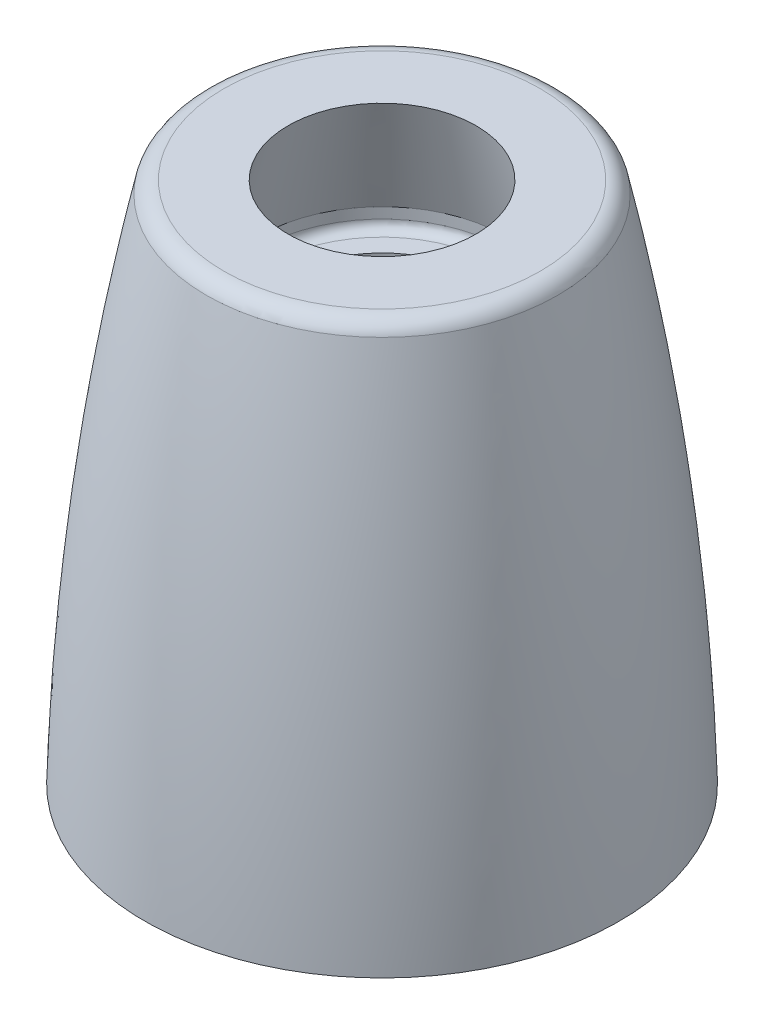
ISO-10303-21;
HEADER;
FILE_DESCRIPTION(('STEP AP214'),'2;1');
FILE_NAME('part.step','',(''),(''),'','','');
FILE_SCHEMA(('AUTOMOTIVE_DESIGN { 1 0 10303 214 1 1 1 1 }'));
ENDSEC;
DATA;
#1=APPLICATION_CONTEXT('core data for automotive mechanical design processes');
#2=APPLICATION_PROTOCOL_DEFINITION('international standard','automotive_design',2000,#1);
#3=PRODUCT_CONTEXT('',#1,'mechanical');
#4=PRODUCT('Part','Part','',(#3));
#5=PRODUCT_RELATED_PRODUCT_CATEGORY('part','',(#4));
#6=PRODUCT_DEFINITION_FORMATION('','',#4);
#7=PRODUCT_DEFINITION_CONTEXT('part definition',#1,'design');
#8=PRODUCT_DEFINITION('design','',#6,#7);
#9=PRODUCT_DEFINITION_SHAPE('','',#8);
#10=(LENGTH_UNIT() NAMED_UNIT(*) SI_UNIT(.MILLI.,.METRE.));
#11=(NAMED_UNIT(*) PLANE_ANGLE_UNIT() SI_UNIT($,.RADIAN.));
#12=(NAMED_UNIT(*) SI_UNIT($,.STERADIAN.) SOLID_ANGLE_UNIT());
#13=UNCERTAINTY_MEASURE_WITH_UNIT(LENGTH_MEASURE(1.E-05),#10,'distance_accuracy_value','');
#14=(GEOMETRIC_REPRESENTATION_CONTEXT(3) GLOBAL_UNCERTAINTY_ASSIGNED_CONTEXT((#13)) GLOBAL_UNIT_ASSIGNED_CONTEXT((#10,
#11,#12)) REPRESENTATION_CONTEXT('',''));
#15=CARTESIAN_POINT('',(0.,0.,0.));
#16=DIRECTION('',(0.,0.,1.));
#17=DIRECTION('',(1.,0.,0.));
#18=AXIS2_PLACEMENT_3D('',#15,#16,#17);
#19=CARTESIAN_POINT('',(6.23062,24.3246111856191,0.));
#20=DIRECTION('',(0.,1.,0.));
#21=DIRECTION('',(0.,0.,1.));
#22=AXIS2_PLACEMENT_3D('',#19,#20,#21);
#23=PLANE('',#22);
#24=CARTESIAN_POINT('',(0.,24.3246111856191,0.));
#25=DIRECTION('',(0.,-1.,0.));
#26=DIRECTION('',(0.,0.,-1.));
#27=AXIS2_PLACEMENT_3D('',#24,#25,#26);
#28=CIRCLE('',#27,6.23062);
#29=CARTESIAN_POINT('',(0.,24.3246111856191,6.23062));
#30=VERTEX_POINT('',#29);
#31=CARTESIAN_POINT('',(0.,24.3246111856191,-6.23062));
#32=VERTEX_POINT('',#31);
#33=EDGE_CURVE('E51',#30,#32,#28,.F.);
#34=ORIENTED_EDGE('',*,*,#33,.T.);
#35=CARTESIAN_POINT('',(0.,24.3246111856191,0.));
#36=DIRECTION('',(0.,-1.,0.));
#37=DIRECTION('',(0.,0.,1.));
#38=AXIS2_PLACEMENT_3D('',#35,#36,#37);
#39=CIRCLE('',#38,6.23062);
#40=EDGE_CURVE('E54',#32,#30,#39,.F.);
#41=ORIENTED_EDGE('',*,*,#40,.T.);
#42=EDGE_LOOP('',(#34,#41));
#43=FACE_BOUND('',#42,.T.);
#44=CARTESIAN_POINT('',(0.,24.3246111856191,0.));
#45=DIRECTION('',(0.,-1.,0.));
#46=DIRECTION('',(0.,0.,-1.));
#47=AXIS2_PLACEMENT_3D('',#44,#45,#46);
#48=CIRCLE('',#47,5.175);
#49=CARTESIAN_POINT('',(0.,24.3246111856191,-5.175));
#50=VERTEX_POINT('',#49);
#51=EDGE_CURVE('E59',#50,#50,#48,.T.);
#52=ORIENTED_EDGE('',*,*,#51,.T.);
#53=EDGE_LOOP('',(#52));
#54=FACE_BOUND('',#53,.T.);
#55=ADVANCED_FACE('F17',(#43,#54),#23,.T.);
#56=CARTESIAN_POINT('',(0.,24.8249911856191,0.));
#57=DIRECTION('',(0.,-1.,0.));
#58=DIRECTION('',(0.,0.,-1.));
#59=AXIS2_PLACEMENT_3D('',#56,#57,#58);
#60=TOROIDAL_SURFACE('',#59,6.23062,0.500380000000001);
#61=ORIENTED_EDGE('',*,*,#40,.F.);
#62=ORIENTED_EDGE('',*,*,#33,.F.);
#63=EDGE_LOOP('',(#61,#62));
#64=FACE_BOUND('',#63,.T.);
#65=CARTESIAN_POINT('',(0.,24.8249911856191,0.));
#66=DIRECTION('',(0.,-1.,0.));
#67=DIRECTION('',(0.,0.,-1.));
#68=AXIS2_PLACEMENT_3D('',#65,#66,#67);
#69=CIRCLE('',#68,6.731);
#70=CARTESIAN_POINT('',(0.,24.8249911856191,-6.731));
#71=VERTEX_POINT('',#70);
#72=EDGE_CURVE('E144',#71,#71,#69,.F.);
#73=ORIENTED_EDGE('',*,*,#72,.T.);
#74=EDGE_LOOP('',(#73));
#75=FACE_BOUND('',#74,.T.);
#76=ADVANCED_FACE('F62',(#64,#75),#60,.F.);
#77=CARTESIAN_POINT('',(0.,31.0037578537676,0.));
#78=DIRECTION('',(0.,-1.,0.));
#79=DIRECTION('',(0.,0.,-1.));
#80=AXIS2_PLACEMENT_3D('',#77,#78,#79);
#81=CYLINDRICAL_SURFACE('',#80,5.175);
#82=CARTESIAN_POINT('',(0.,15.7722628656191,0.));
#83=DIRECTION('',(0.,-1.,0.));
#84=DIRECTION('',(0.,0.,-1.));
#85=AXIS2_PLACEMENT_3D('',#82,#83,#84);
#86=CIRCLE('',#85,5.175);
#87=CARTESIAN_POINT('',(0.,15.7722628656191,-5.175));
#88=VERTEX_POINT('',#87);
#89=EDGE_CURVE('E143',#88,#88,#86,.F.);
#90=ORIENTED_EDGE('',*,*,#89,.F.);
#91=EDGE_LOOP('',(#90));
#92=FACE_BOUND('',#91,.T.);
#93=ORIENTED_EDGE('',*,*,#51,.F.);
#94=EDGE_LOOP('',(#93));
#95=FACE_BOUND('',#94,.T.);
#96=ADVANCED_FACE('F150',(#92,#95),#81,.F.);
#97=CARTESIAN_POINT('',(0.,31.0037578537676,0.));
#98=DIRECTION('',(0.,-1.,0.));
#99=DIRECTION('',(0.,0.,-1.));
#100=AXIS2_PLACEMENT_3D('',#97,#98,#99);
#101=CYLINDRICAL_SURFACE('',#100,6.731);
#102=ORIENTED_EDGE('',*,*,#72,.F.);
#103=EDGE_LOOP('',(#102));
#104=FACE_BOUND('',#103,.T.);
#105=CARTESIAN_POINT('',(0.,25.4097866327925,0.));
#106=DIRECTION('',(0.,-1.,0.));
#107=DIRECTION('',(0.,0.,-1.));
#108=AXIS2_PLACEMENT_3D('',#105,#106,#107);
#109=CIRCLE('',#108,6.73100000000204);
#110=CARTESIAN_POINT('',(0.,25.4097866327925,-6.73100000000204));
#111=VERTEX_POINT('',#110);
#112=EDGE_CURVE('E135',#111,#111,#109,.F.);
#113=ORIENTED_EDGE('',*,*,#112,.T.);
#114=EDGE_LOOP('',(#113));
#115=FACE_BOUND('',#114,.T.);
#116=ADVANCED_FACE('F118',(#104,#115),#101,.F.);
#117=CARTESIAN_POINT('',(5.175,15.7722628656191,0.));
#118=DIRECTION('',(0.,-1.,0.));
#119=DIRECTION('',(0.,0.,-1.));
#120=AXIS2_PLACEMENT_3D('',#117,#118,#119);
#121=PLANE('',#120);
#122=ORIENTED_EDGE('',*,*,#89,.T.);
#123=EDGE_LOOP('',(#122));
#124=FACE_BOUND('',#123,.T.);
#125=CARTESIAN_POINT('',(0.,15.7722628656191,0.));
#126=DIRECTION('',(0.,1.,0.));
#127=DIRECTION('',(0.,0.,1.));
#128=AXIS2_PLACEMENT_3D('',#125,#126,#127);
#129=CIRCLE('',#128,7.779);
#130=CARTESIAN_POINT('',(0.,15.7722628656191,-7.779));
#131=VERTEX_POINT('',#130);
#132=CARTESIAN_POINT('',(0.,15.7722628656191,7.779));
#133=VERTEX_POINT('',#132);
#134=EDGE_CURVE('E103',#131,#133,#129,.F.);
#135=ORIENTED_EDGE('',*,*,#134,.T.);
#136=CARTESIAN_POINT('',(0.,15.7722628656191,0.));
#137=DIRECTION('',(0.,1.,0.));
#138=DIRECTION('',(0.,0.,-1.));
#139=AXIS2_PLACEMENT_3D('',#136,#137,#138);
#140=CIRCLE('',#139,7.779);
#141=EDGE_CURVE('E131',#133,#131,#140,.F.);
#142=ORIENTED_EDGE('',*,*,#141,.T.);
#143=EDGE_LOOP('',(#135,#142));
#144=FACE_BOUND('',#143,.T.);
#145=ADVANCED_FACE('F109',(#124,#144),#121,.T.);
#146=CARTESIAN_POINT('',(0.,25.4097866327925,0.));
#147=DIRECTION('',(0.,-1.,0.));
#148=DIRECTION('',(0.,0.,-1.));
#149=AXIS2_PLACEMENT_3D('',#146,#147,#148);
#150=CONICAL_SURFACE('',#149,6.73100000000204,0.25960730001697);
#151=ORIENTED_EDGE('',*,*,#112,.F.);
#152=EDGE_LOOP('',(#151));
#153=FACE_BOUND('',#152,.T.);
#154=CARTESIAN_POINT('',(0.,31.4346111856594,0.));
#155=DIRECTION('',(0.,-1.,0.));
#156=DIRECTION('',(0.,0.,-1.));
#157=AXIS2_PLACEMENT_3D('',#154,#155,#156);
#158=CIRCLE('',#157,5.13079999998922);
#159=CARTESIAN_POINT('',(0.,31.4346111856594,-5.13079999998922));
#160=VERTEX_POINT('',#159);
#161=EDGE_CURVE('E164',#160,#160,#158,.T.);
#162=ORIENTED_EDGE('',*,*,#161,.F.);
#163=EDGE_LOOP('',(#162));
#164=FACE_BOUND('',#163,.T.);
#165=ADVANCED_FACE('F82',(#153,#164),#150,.F.);
#166=CARTESIAN_POINT('',(0.,13.7722628656191,0.));
#167=DIRECTION('',(0.,-1.,0.));
#168=DIRECTION('',(0.,0.,-1.));
#169=AXIS2_PLACEMENT_3D('',#166,#167,#168);
#170=TOROIDAL_SURFACE('',#169,7.779,2.);
#171=CARTESIAN_POINT('',(0.,13.7722628656191,0.));
#172=DIRECTION('',(0.,-1.,0.));
#173=DIRECTION('',(0.,0.,-1.));
#174=AXIS2_PLACEMENT_3D('',#171,#172,#173);
#175=CIRCLE('',#174,9.779);
#176=CARTESIAN_POINT('',(0.,13.7722628656191,-9.779));
#177=VERTEX_POINT('',#176);
#178=EDGE_CURVE('E96',#177,#177,#175,.T.);
#179=ORIENTED_EDGE('',*,*,#178,.T.);
#180=EDGE_LOOP('',(#179));
#181=FACE_BOUND('',#180,.T.);
#182=ORIENTED_EDGE('',*,*,#141,.F.);
#183=ORIENTED_EDGE('',*,*,#134,.F.);
#184=EDGE_LOOP('',(#182,#183));
#185=FACE_BOUND('',#184,.T.);
#186=ADVANCED_FACE('F70',(#181,#185),#170,.F.);
#187=CARTESIAN_POINT('',(8.63475526060741,31.4346111856191,0.));
#188=DIRECTION('',(0.,1.,0.));
#189=DIRECTION('',(0.,0.,1.));
#190=AXIS2_PLACEMENT_3D('',#187,#188,#189);
#191=PLANE('',#190);
#192=CARTESIAN_POINT('',(0.,31.4346111856191,0.));
#193=DIRECTION('',(0.,-1.,0.));
#194=DIRECTION('',(0.,0.,-1.));
#195=AXIS2_PLACEMENT_3D('',#192,#193,#194);
#196=CIRCLE('',#195,8.63475526060741);
#197=CARTESIAN_POINT('',(0.,31.4346111856191,-8.63475526060741));
#198=VERTEX_POINT('',#197);
#199=CARTESIAN_POINT('',(0.,31.4346111856191,8.63475526060741));
#200=VERTEX_POINT('',#199);
#201=EDGE_CURVE('E36',#198,#200,#196,.T.);
#202=ORIENTED_EDGE('',*,*,#201,.F.);
#203=CARTESIAN_POINT('',(0.,31.4346111856191,0.));
#204=DIRECTION('',(0.,-1.,0.));
#205=DIRECTION('',(0.,0.,1.));
#206=AXIS2_PLACEMENT_3D('',#203,#204,#205);
#207=CIRCLE('',#206,8.63475526060741);
#208=EDGE_CURVE('E99',#200,#198,#207,.T.);
#209=ORIENTED_EDGE('',*,*,#208,.F.);
#210=EDGE_LOOP('',(#202,#209));
#211=FACE_BOUND('',#210,.T.);
#212=ORIENTED_EDGE('',*,*,#161,.T.);
#213=EDGE_LOOP('',(#212));
#214=FACE_BOUND('',#213,.T.);
#215=ADVANCED_FACE('F81',(#211,#214),#191,.T.);
#216=CARTESIAN_POINT('',(0.,31.0037578537676,0.));
#217=DIRECTION('',(0.,-1.,0.));
#218=DIRECTION('',(0.,0.,-1.));
#219=AXIS2_PLACEMENT_3D('',#216,#217,#218);
#220=CYLINDRICAL_SURFACE('',#219,9.779);
#221=CARTESIAN_POINT('',(0.,2.85961118561913,0.));
#222=DIRECTION('',(0.,-1.,0.));
#223=DIRECTION('',(0.,0.,-1.));
#224=AXIS2_PLACEMENT_3D('',#221,#222,#223);
#225=CIRCLE('',#224,9.779);
#226=CARTESIAN_POINT('',(0.,2.85961118561913,-9.779));
#227=VERTEX_POINT('',#226);
#228=EDGE_CURVE('E161',#227,#227,#225,.F.);
#229=ORIENTED_EDGE('',*,*,#228,.F.);
#230=EDGE_LOOP('',(#229));
#231=FACE_BOUND('',#230,.T.);
#232=ORIENTED_EDGE('',*,*,#178,.F.);
#233=EDGE_LOOP('',(#232));
#234=FACE_BOUND('',#233,.T.);
#235=ADVANCED_FACE('F185',(#231,#234),#220,.F.);
#236=CARTESIAN_POINT('',(0.,30.4346111856202,0.));
#237=DIRECTION('',(0.,-1.,0.));
#238=DIRECTION('',(0.,0.,-1.));
#239=AXIS2_PLACEMENT_3D('',#236,#237,#238);
#240=TOROIDAL_SURFACE('',#239,8.63475526060741,0.999999999998937);
#241=ORIENTED_EDGE('',*,*,#201,.T.);
#242=ORIENTED_EDGE('',*,*,#208,.T.);
#243=EDGE_LOOP('',(#241,#242));
#244=FACE_BOUND('',#243,.T.);
#245=CARTESIAN_POINT('',(0.,30.7624474661682,0.));
#246=DIRECTION('',(0.,-1.,0.));
#247=DIRECTION('',(0.,0.,-1.));
#248=AXIS2_PLACEMENT_3D('',#245,#246,#247);
#249=CIRCLE('',#248,9.57948981229606);
#250=CARTESIAN_POINT('',(0.,30.7624474661682,-9.57948981229606));
#251=VERTEX_POINT('',#250);
#252=EDGE_CURVE('E28',#251,#251,#249,.T.);
#253=ORIENTED_EDGE('',*,*,#252,.F.);
#254=EDGE_LOOP('',(#253));
#255=FACE_BOUND('',#254,.T.);
#256=ADVANCED_FACE('F174',(#244,#255),#240,.T.);
#257=CARTESIAN_POINT('',(9.779,2.85961118561911,0.));
#258=DIRECTION('',(0.,-1.,0.));
#259=DIRECTION('',(0.,0.,-1.));
#260=AXIS2_PLACEMENT_3D('',#257,#258,#259);
#261=PLANE('',#260);
#262=ORIENTED_EDGE('',*,*,#228,.T.);
#263=EDGE_LOOP('',(#262));
#264=FACE_BOUND('',#263,.T.);
#265=CARTESIAN_POINT('',(0.,2.85961118561912,0.));
#266=DIRECTION('',(0.,-1.,0.));
#267=DIRECTION('',(0.,0.,-1.));
#268=AXIS2_PLACEMENT_3D('',#265,#266,#267);
#269=CIRCLE('',#268,12.9487371025054);
#270=CARTESIAN_POINT('',(0.,2.85961118561912,-12.9487371025054));
#271=VERTEX_POINT('',#270);
#272=EDGE_CURVE('E11',#271,#271,#269,.F.);
#273=ORIENTED_EDGE('',*,*,#272,.F.);
#274=EDGE_LOOP('',(#273));
#275=FACE_BOUND('',#274,.T.);
#276=ADVANCED_FACE('F184',(#264,#275),#261,.T.);
#277=CARTESIAN_POINT('',(0.,-1.20724054969762,137.956407060144));
#278=DIRECTION('',(1.,0.,0.));
#279=DIRECTION('',(0.,0.,-1.));
#280=AXIS2_PLACEMENT_3D('',#277,#278,#279);
#281=CIRCLE('',#280,150.959934478613);
#282=TRIMMED_CURVE('',#281,(PARAMETER_VALUE(-0.418102383685094)),
(PARAMETER_VALUE(0.418102383685094)),.T.,.PARAMETER.);
#283=CARTESIAN_POINT('',(0.,-1.20724054969762,0.));
#284=DIRECTION('',(0.,-1.,0.));
#285=AXIS1_PLACEMENT('',#283,#284);
#286=SURFACE_OF_REVOLUTION('',#282,#285);
#287=ORIENTED_EDGE('',*,*,#252,.T.);
#288=EDGE_LOOP('',(#287));
#289=FACE_BOUND('',#288,.T.);
#290=ORIENTED_EDGE('',*,*,#272,.T.);
#291=EDGE_LOOP('',(#290));
#292=FACE_BOUND('',#291,.T.);
#293=ADVANCED_FACE('F212',(#289,#292),#286,.F.);
#294=CLOSED_SHELL('',(#55,#76,#96,#116,#145,#165,#186,#215,#235,#256,#276,#293));
#295=MANIFOLD_SOLID_BREP('B1',#294);
#296=ADVANCED_BREP_SHAPE_REPRESENTATION('',(#18,#295),#14);
#297=SHAPE_DEFINITION_REPRESENTATION(#9,#296);
ENDSEC;
END-ISO-10303-21;
